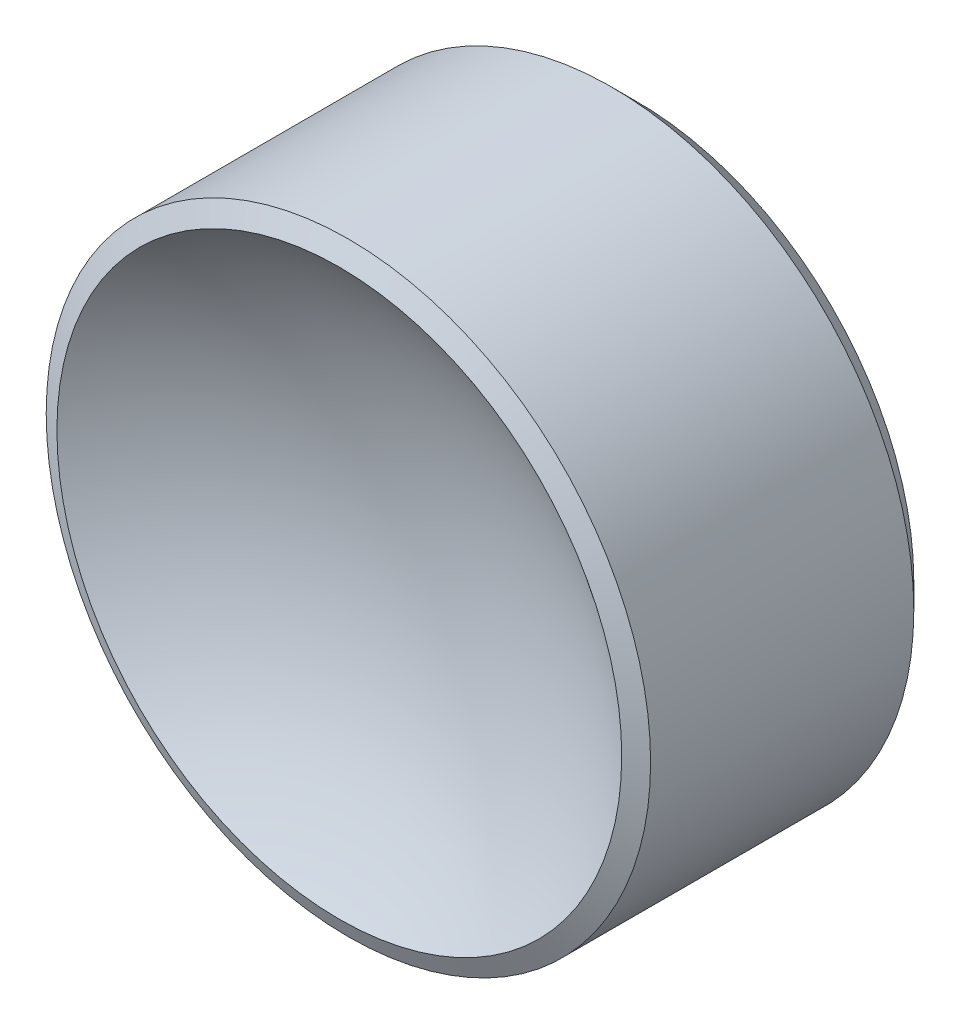
ISO-10303-21;
HEADER;
FILE_DESCRIPTION(('STEP AP214'),'2;1');
FILE_NAME('part.step','',(''),(''),'','','');
FILE_SCHEMA(('AUTOMOTIVE_DESIGN { 1 0 10303 214 1 1 1 1 }'));
ENDSEC;
DATA;
#1=APPLICATION_CONTEXT('core data for automotive mechanical design processes');
#2=APPLICATION_PROTOCOL_DEFINITION('international standard','automotive_design',2000,#1);
#3=PRODUCT_CONTEXT('',#1,'mechanical');
#4=PRODUCT('Part','Part','',(#3));
#5=PRODUCT_RELATED_PRODUCT_CATEGORY('part','',(#4));
#6=PRODUCT_DEFINITION_FORMATION('','',#4);
#7=PRODUCT_DEFINITION_CONTEXT('part definition',#1,'design');
#8=PRODUCT_DEFINITION('design','',#6,#7);
#9=PRODUCT_DEFINITION_SHAPE('','',#8);
#10=(LENGTH_UNIT() NAMED_UNIT(*) SI_UNIT(.MILLI.,.METRE.));
#11=(NAMED_UNIT(*) PLANE_ANGLE_UNIT() SI_UNIT($,.RADIAN.));
#12=(NAMED_UNIT(*) SI_UNIT($,.STERADIAN.) SOLID_ANGLE_UNIT());
#13=UNCERTAINTY_MEASURE_WITH_UNIT(LENGTH_MEASURE(1.E-05),#10,'distance_accuracy_value','');
#14=(GEOMETRIC_REPRESENTATION_CONTEXT(3) GLOBAL_UNCERTAINTY_ASSIGNED_CONTEXT((#13)) GLOBAL_UNIT_ASSIGNED_CONTEXT((#10,
#11,#12)) REPRESENTATION_CONTEXT('',''));
#15=CARTESIAN_POINT('',(0.,0.,0.));
#16=DIRECTION('',(0.,0.,1.));
#17=DIRECTION('',(1.,0.,0.));
#18=AXIS2_PLACEMENT_3D('',#15,#16,#17);
#19=CARTESIAN_POINT('',(0.,0.,5.12348142191772));
#20=DIRECTION('',(0.,0.,1.));
#21=DIRECTION('',(0.,1.,0.));
#22=AXIS2_PLACEMENT_3D('',#19,#20,#21);
#23=SPHERICAL_SURFACE('',#22,4.59999999999999);
#24=CARTESIAN_POINT('',(0.,0.,1.47651857808228));
#25=DIRECTION('',(0.,0.,1.));
#26=DIRECTION('',(1.,0.,0.));
#27=AXIS2_PLACEMENT_3D('',#24,#25,#26);
#28=CIRCLE('',#27,2.80350887562063);
#29=CARTESIAN_POINT('',(2.80350887562063,0.,1.47651857808228));
#30=VERTEX_POINT('',#29);
#31=EDGE_CURVE('E9',#30,#30,#28,.T.);
#32=ORIENTED_EDGE('',*,*,#31,.T.);
#33=EDGE_LOOP('',(#32));
#34=FACE_BOUND('',#33,.T.);
#35=ADVANCED_FACE('F13',(#34),#23,.F.);
#36=CARTESIAN_POINT('',(0.,0.,0.523481421917724));
#37=DIRECTION('',(0.,0.,1.));
#38=DIRECTION('',(1.,0.,0.));
#39=AXIS2_PLACEMENT_3D('',#36,#37,#38);
#40=CYLINDRICAL_SURFACE('',#39,3.);
#41=CARTESIAN_POINT('',(0.,0.,-1.22651857808227));
#42=DIRECTION('',(0.,0.,1.));
#43=DIRECTION('',(1.,0.,0.));
#44=AXIS2_PLACEMENT_3D('',#41,#42,#43);
#45=CIRCLE('',#44,3.);
#46=CARTESIAN_POINT('',(3.,0.,-1.22651857808227));
#47=VERTEX_POINT('',#46);
#48=EDGE_CURVE('E24',#47,#47,#45,.T.);
#49=ORIENTED_EDGE('',*,*,#48,.T.);
#50=EDGE_LOOP('',(#49));
#51=FACE_BOUND('',#50,.T.);
#52=CARTESIAN_POINT('',(0.,0.,1.38636226708519));
#53=DIRECTION('',(0.,0.,-1.));
#54=DIRECTION('',(-1.,0.,0.));
#55=AXIS2_PLACEMENT_3D('',#52,#53,#54);
#56=CIRCLE('',#55,3.);
#57=CARTESIAN_POINT('',(-3.,0.,1.38636226708519));
#58=VERTEX_POINT('',#57);
#59=EDGE_CURVE('E28',#58,#58,#56,.T.);
#60=ORIENTED_EDGE('',*,*,#59,.T.);
#61=EDGE_LOOP('',(#60));
#62=FACE_BOUND('',#61,.T.);
#63=ADVANCED_FACE('F34',(#51,#62),#40,.T.);
#64=CARTESIAN_POINT('',(0.,0.,-1.47651857808228));
#65=DIRECTION('',(0.,0.,1.));
#66=DIRECTION('',(1.,0.,0.));
#67=AXIS2_PLACEMENT_3D('',#64,#65,#66);
#68=PLANE('',#67);
#69=CARTESIAN_POINT('',(0.,0.,-1.47651857808228));
#70=DIRECTION('',(0.,0.,1.));
#71=DIRECTION('',(1.,0.,0.));
#72=AXIS2_PLACEMENT_3D('',#69,#70,#71);
#73=CIRCLE('',#72,2.75);
#74=CARTESIAN_POINT('',(2.75,0.,-1.47651857808228));
#75=VERTEX_POINT('',#74);
#76=EDGE_CURVE('E20',#75,#75,#73,.F.);
#77=ORIENTED_EDGE('',*,*,#76,.T.);
#78=EDGE_LOOP('',(#77));
#79=FACE_BOUND('',#78,.T.);
#80=ADVANCED_FACE('F43',(#79),#68,.F.);
#81=CARTESIAN_POINT('',(0.,0.,-1.22651857808227));
#82=DIRECTION('',(0.,0.,1.));
#83=DIRECTION('',(1.,0.,0.));
#84=AXIS2_PLACEMENT_3D('',#81,#82,#83);
#85=CONICAL_SURFACE('',#84,3.,0.785398163397449);
#86=ORIENTED_EDGE('',*,*,#76,.F.);
#87=EDGE_LOOP('',(#86));
#88=FACE_BOUND('',#87,.T.);
#89=ORIENTED_EDGE('',*,*,#48,.F.);
#90=EDGE_LOOP('',(#89));
#91=FACE_BOUND('',#90,.T.);
#92=ADVANCED_FACE('F38',(#88,#91),#85,.T.);
#93=CARTESIAN_POINT('',(0.,0.,1.47651857808228));
#94=DIRECTION('',(0.,0.,-1.));
#95=DIRECTION('',(-1.,0.,0.));
#96=AXIS2_PLACEMENT_3D('',#93,#94,#95);
#97=CONICAL_SURFACE('',#96,2.80350887562063,1.14062246767406);
#98=ORIENTED_EDGE('',*,*,#59,.F.);
#99=EDGE_LOOP('',(#98));
#100=FACE_BOUND('',#99,.T.);
#101=ORIENTED_EDGE('',*,*,#31,.F.);
#102=EDGE_LOOP('',(#101));
#103=FACE_BOUND('',#102,.T.);
#104=ADVANCED_FACE('F15',(#100,#103),#97,.T.);
#105=CLOSED_SHELL('',(#35,#63,#80,#92,#104));
#106=MANIFOLD_SOLID_BREP('B1',#105);
#107=ADVANCED_BREP_SHAPE_REPRESENTATION('',(#18,#106),#14);
#108=SHAPE_DEFINITION_REPRESENTATION(#9,#107);
ENDSEC;
END-ISO-10303-21;
